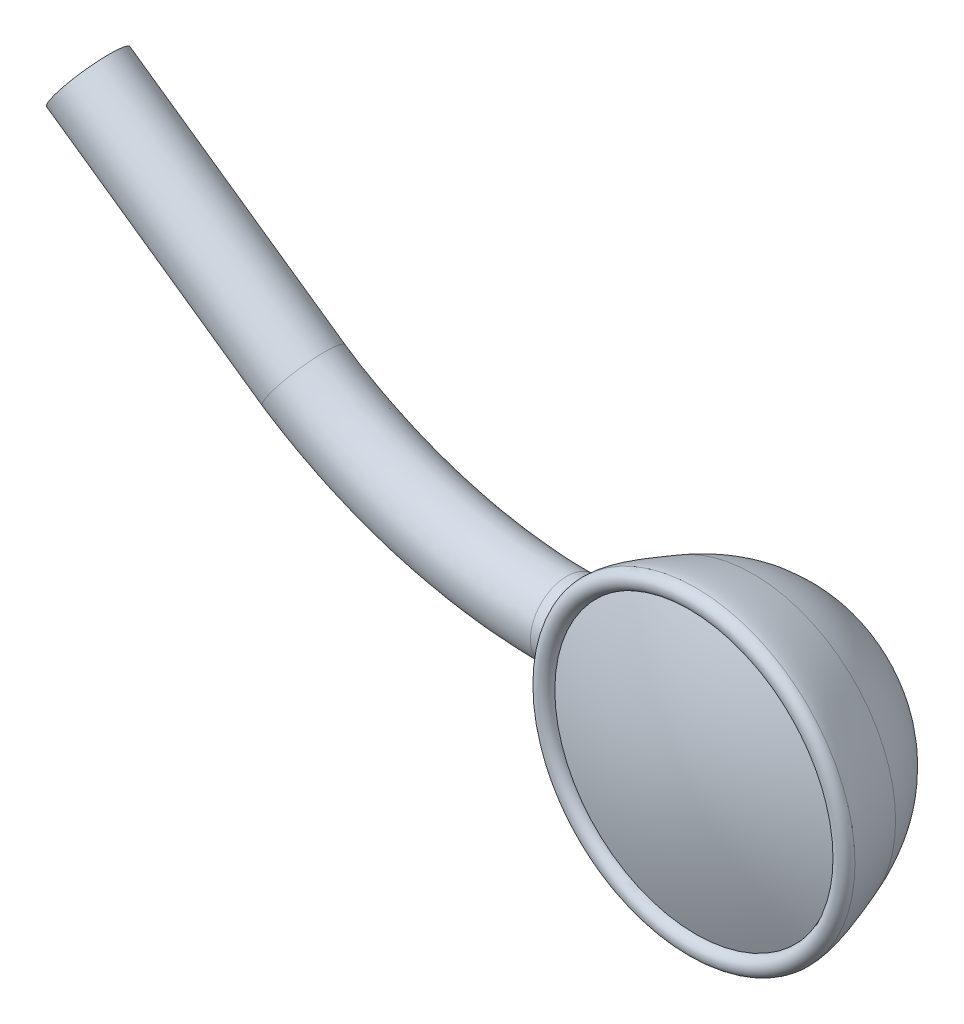
ISO-10303-21;
HEADER;
FILE_DESCRIPTION(('STEP AP214'),'2;1');
FILE_NAME('part.step','',(''),(''),'','','');
FILE_SCHEMA(('AUTOMOTIVE_DESIGN { 1 0 10303 214 1 1 1 1 }'));
ENDSEC;
DATA;
#1=APPLICATION_CONTEXT('core data for automotive mechanical design processes');
#2=APPLICATION_PROTOCOL_DEFINITION('international standard','automotive_design',2000,#1);
#3=PRODUCT_CONTEXT('',#1,'mechanical');
#4=PRODUCT('Part','Part','',(#3));
#5=PRODUCT_RELATED_PRODUCT_CATEGORY('part','',(#4));
#6=PRODUCT_DEFINITION_FORMATION('','',#4);
#7=PRODUCT_DEFINITION_CONTEXT('part definition',#1,'design');
#8=PRODUCT_DEFINITION('design','',#6,#7);
#9=PRODUCT_DEFINITION_SHAPE('','',#8);
#10=(LENGTH_UNIT() NAMED_UNIT(*) SI_UNIT(.MILLI.,.METRE.));
#11=(NAMED_UNIT(*) PLANE_ANGLE_UNIT() SI_UNIT($,.RADIAN.));
#12=(NAMED_UNIT(*) SI_UNIT($,.STERADIAN.) SOLID_ANGLE_UNIT());
#13=UNCERTAINTY_MEASURE_WITH_UNIT(LENGTH_MEASURE(1.E-05),#10,'distance_accuracy_value','');
#14=(GEOMETRIC_REPRESENTATION_CONTEXT(3) GLOBAL_UNCERTAINTY_ASSIGNED_CONTEXT((#13)) GLOBAL_UNIT_ASSIGNED_CONTEXT((#10,
#11,#12)) REPRESENTATION_CONTEXT('',''));
#15=CARTESIAN_POINT('',(0.,0.,0.));
#16=DIRECTION('',(0.,0.,1.));
#17=DIRECTION('',(1.,0.,0.));
#18=AXIS2_PLACEMENT_3D('',#15,#16,#17);
#19=CARTESIAN_POINT('',(-33.3759610218491,6.32528048127308,38.7475650776062));
#20=DIRECTION('',(0.,0.,-1.));
#21=DIRECTION('',(-1.,0.,0.));
#22=AXIS2_PLACEMENT_3D('',#19,#20,#21);
#23=TOROIDAL_SURFACE('',#22,2.67006462568478,0.161745723488841);
#24=CARTESIAN_POINT('',(-33.3759610218491,6.32528048127308,38.7475650776062));
#25=DIRECTION('',(0.,0.,-1.));
#26=DIRECTION('',(-1.,0.,0.));
#27=AXIS2_PLACEMENT_3D('',#24,#25,#26);
#28=CIRCLE('',#27,2.83181034917362);
#29=CARTESIAN_POINT('',(-36.2077713710227,6.32528048127308,38.7475650776062));
#30=VERTEX_POINT('',#29);
#31=EDGE_CURVE('E12',#30,#30,#28,.T.);
#32=ORIENTED_EDGE('',*,*,#31,.F.);
#33=EDGE_LOOP('',(#32));
#34=FACE_BOUND('',#33,.T.);
#35=CARTESIAN_POINT('',(-33.3759610218491,6.32528048127308,38.7475650776062));
#36=DIRECTION('',(0.,0.,-1.));
#37=DIRECTION('',(-1.,0.,0.));
#38=AXIS2_PLACEMENT_3D('',#35,#36,#37);
#39=CIRCLE('',#38,2.50831890219594);
#40=CARTESIAN_POINT('',(-35.884279924045,6.32528048127308,38.7475650776062));
#41=VERTEX_POINT('',#40);
#42=EDGE_CURVE('E60',#41,#41,#39,.T.);
#43=ORIENTED_EDGE('',*,*,#42,.T.);
#44=EDGE_LOOP('',(#43));
#45=FACE_BOUND('',#44,.T.);
#46=ADVANCED_FACE('F51',(#34,#45),#23,.T.);
#47=CARTESIAN_POINT('',(-35.9127425481212,6.32528048127308,37.7293758331895));
#48=CARTESIAN_POINT('',(-36.2077713710227,6.32528048127308,38.5109618998965));
#49=CARTESIAN_POINT('',(-36.2077713710227,6.32528048127308,38.7475650776062));
#50=B_SPLINE_CURVE_WITH_KNOTS('',2,(#47,#48,#49),.UNSPECIFIED.,.F.,.F.,(3,3),(0.,1.),.UNSPECIFIED.);
#51=CARTESIAN_POINT('',(-33.3759610218491,6.32528048127308,38.5428918715614));
#52=DIRECTION('',(0.,0.,-1.));
#53=AXIS1_PLACEMENT('',#51,#52);
#54=SURFACE_OF_REVOLUTION('',#50,#53);
#55=CARTESIAN_POINT('',(-35.8366631157367,5.70867224489234,37.7293758331895));
#56=CARTESIAN_POINT('',(-35.8453147656156,5.71452767314581,37.7478391693856));
#57=CARTESIAN_POINT('',(-35.8539920785709,5.72120791889198,37.7660284696626));
#58=CARTESIAN_POINT('',(-35.8712876700008,5.73616983047684,37.8017269053988));
#59=CARTESIAN_POINT('',(-35.8799060170333,5.74444910215327,37.8192370113018));
#60=CARTESIAN_POINT('',(-35.8970412696356,5.762622664758,37.8535839734428));
#61=CARTESIAN_POINT('',(-35.9055574758623,5.77252463210552,37.8704171314708));
#62=CARTESIAN_POINT('',(-35.9223543983339,5.79388971006259,37.9032308382117));
#63=CARTESIAN_POINT('',(-35.9306346520882,5.80535566168821,37.9192097599116));
#64=CARTESIAN_POINT('',(-35.9549532042186,5.84204030133587,37.9656690435886));
#65=CARTESIAN_POINT('',(-35.9704698752245,5.8695463807755,37.9946730778542));
#66=CARTESIAN_POINT('',(-35.9991382954304,5.93010767040174,38.0475458642674));
#67=CARTESIAN_POINT('',(-36.0122932617168,5.96315521147534,38.0714216109567));
#68=CARTESIAN_POINT('',(-36.0343666785619,6.03106128283361,38.1111550953871));
#69=CARTESIAN_POINT('',(-36.0435473206518,6.06553759645398,38.1275161897194));
#70=CARTESIAN_POINT('',(-36.058489990327,6.13749361235207,38.154037548141));
#71=CARTESIAN_POINT('',(-36.0642549687797,6.174970690331,38.1642031648585));
#72=CARTESIAN_POINT('',(-36.0713948901646,6.24645254162278,38.1767776085079));
#73=CARTESIAN_POINT('',(-36.0732489874549,6.28026239279216,38.1800334158611));
#74=CARTESIAN_POINT('',(-36.0739118411888,6.3479971320981,38.1811983512119));
#75=CARTESIAN_POINT('',(-36.0727219839279,6.38192196084309,38.1791099131167));
#76=CARTESIAN_POINT('',(-36.067549850494,6.44666859070041,38.1700080191207));
#77=CARTESIAN_POINT('',(-36.0637488489278,6.47755098267108,38.1633142386376));
#78=CARTESIAN_POINT('',(-36.0537645140728,6.53765780749648,38.1456573066964));
#79=CARTESIAN_POINT('',(-36.0475809878503,6.56688210586105,38.1346938094815));
#80=CARTESIAN_POINT('',(-36.032876022572,6.62408724168076,38.1084571177646));
#81=CARTESIAN_POINT('',(-36.0242754920397,6.65198014113223,38.0930375124248));
#82=CARTESIAN_POINT('',(-36.0052503914948,6.70482379786665,38.0586126119636));
#83=CARTESIAN_POINT('',(-35.9948225777268,6.72976918868674,38.039600935496));
#84=CARTESIAN_POINT('',(-35.9713876340448,6.77883309682954,37.9963480865731));
#85=CARTESIAN_POINT('',(-35.958223701485,6.80257385014605,37.9717643365286));
#86=CARTESIAN_POINT('',(-35.9307472441421,6.84570186071436,37.9195246275618));
#87=CARTESIAN_POINT('',(-35.9164325973089,6.8650808121964,37.8918629547694));
#88=CARTESIAN_POINT('',(-35.8911289179942,6.89464902248757,37.8418412877474));
#89=CARTESIAN_POINT('',(-35.8802726500873,6.9059103622867,37.8200382155502));
#90=CARTESIAN_POINT('',(-35.8584852652785,6.92583916467082,37.7754254213999));
#91=CARTESIAN_POINT('',(-35.8475545596775,6.93451583809476,37.7526196146741));
#92=CARTESIAN_POINT('',(-35.8366631157367,6.94188871765382,37.7293758331895));
#93=B_SPLINE_CURVE_WITH_KNOTS('',3,(#55,#56,#57,#58,#59,#60,#61,#62,#63,#64,#65,#66,#67,#68,#69,
#70,#71,#72,#73,#74,#75,#76,#77,#78,#79,#80,#81,#82,#83,#84,#85,#86,#87,#88,#89,#90,#91,#92),
.UNSPECIFIED.,.F.,.F.,(4,2,2,2,2,2,2,2,2,2,2,2,2,2,2,2,2,2,4),(0.,0.0636232112335555,
0.127151890119804,0.190990269760106,0.25494619728965,0.382853825182514,0.510585874470745,
0.627642135828131,0.744597121676691,0.846109210507948,0.947575076345156,1.0426268804407,
1.13768638332432,1.23631646841177,1.33512344686202,1.44456174789036,1.55420671139311,
1.63457071346741,1.71464480296047),.UNSPECIFIED.);
#94=CARTESIAN_POINT('',(-35.8366631157367,5.70867224489234,37.7293758331895));
#95=VERTEX_POINT('',#94);
#96=CARTESIAN_POINT('',(-35.8366631157367,6.94188871765382,37.7293758331895));
#97=VERTEX_POINT('',#96);
#98=EDGE_CURVE('E66',#95,#97,#93,.T.);
#99=ORIENTED_EDGE('',*,*,#98,.F.);
#100=CARTESIAN_POINT('',(-33.3759610218491,6.32528048127308,37.7293758331895));
#101=DIRECTION('',(0.,0.,-1.));
#102=DIRECTION('',(-1.,0.,0.));
#103=AXIS2_PLACEMENT_3D('',#100,#101,#102);
#104=CIRCLE('',#103,2.53678152627212);
#105=EDGE_CURVE('E69',#97,#95,#104,.T.);
#106=ORIENTED_EDGE('',*,*,#105,.F.);
#107=EDGE_LOOP('',(#99,#106));
#108=FACE_BOUND('',#107,.T.);
#109=ORIENTED_EDGE('',*,*,#31,.T.);
#110=EDGE_LOOP('',(#109));
#111=FACE_BOUND('',#110,.T.);
#112=ADVANCED_FACE('F137',(#108,#111),#54,.F.);
#113=CARTESIAN_POINT('',(-33.3759610218491,6.32528048127308,35.9982186655167));
#114=CARTESIAN_POINT('',(-35.2592748326744,6.32528048127308,35.9982186655167));
#115=CARTESIAN_POINT('',(-35.9127425481212,6.32528048127308,37.7293758331895));
#116=B_SPLINE_CURVE_WITH_KNOTS('',2,(#113,#114,#115),.UNSPECIFIED.,.F.,.F.,(3,3),(0.,1.),.UNSPECIFIED.);
#117=CARTESIAN_POINT('',(-33.3759610218491,6.32528048127308,38.5428918715614));
#118=DIRECTION('',(0.,0.,-1.));
#119=AXIS1_PLACEMENT('',#117,#118);
#120=SURFACE_OF_REVOLUTION('',#116,#119);
#121=CARTESIAN_POINT('',(-35.8366631157367,6.94188871765382,37.7293758331895));
#122=CARTESIAN_POINT('',(-35.8187976448711,6.95398969437908,37.6912685161995));
#123=CARTESIAN_POINT('',(-35.8006042696638,6.96247814504994,37.6521891302451));
#124=CARTESIAN_POINT('',(-35.7640102154432,6.97216974226241,37.573215834083));
#125=CARTESIAN_POINT('',(-35.7456094776004,6.97337076640056,37.5333216899776));
#126=CARTESIAN_POINT('',(-35.7089951677291,6.96841133757217,37.4537307872917));
#127=CARTESIAN_POINT('',(-35.6907824936837,6.96222469799498,37.4140352346901));
#128=CARTESIAN_POINT('',(-35.6550515672563,6.94251648062271,37.3361841881156));
#129=CARTESIAN_POINT('',(-35.6375331294374,6.92899687589493,37.2980282828384));
#130=CARTESIAN_POINT('',(-35.6038693444127,6.89504388058971,37.2249579996403));
#131=CARTESIAN_POINT('',(-35.5877092302884,6.87470168570272,37.1900082307804));
#132=CARTESIAN_POINT('',(-35.5570327507096,6.8274400956231,37.1240668069465));
#133=CARTESIAN_POINT('',(-35.5425151374896,6.80052574289379,37.0930721450595));
#134=CARTESIAN_POINT('',(-35.5165618089117,6.74260600255518,37.0380909245191));
#135=CARTESIAN_POINT('',(-35.5049895753441,6.71196504811429,37.0137859250618));
#136=CARTESIAN_POINT('',(-35.4843827204404,6.64619481637912,36.9708236777989));
#137=CARTESIAN_POINT('',(-35.4753460519089,6.61106919350858,36.9521618727705));
#138=CARTESIAN_POINT('',(-35.4611126198351,6.540990930282,36.9229371743526));
#139=CARTESIAN_POINT('',(-35.4556288291746,6.50635068095155,36.9117651717619));
#140=CARTESIAN_POINT('',(-35.4475616494678,6.43536976003189,36.8953747965783));
#141=CARTESIAN_POINT('',(-35.4449762422825,6.39903028999596,36.8901522813274));
#142=CARTESIAN_POINT('',(-35.4429819281987,6.32909436212129,36.8861221759403));
#143=CARTESIAN_POINT('',(-35.4433165404108,6.29553391480288,36.8867966338481));
#144=CARTESIAN_POINT('',(-35.4465337361661,6.22904564377892,36.8933029655456));
#145=CARTESIAN_POINT('',(-35.4494159951513,6.19611774003627,36.8991341823888));
#146=CARTESIAN_POINT('',(-35.4574690229153,6.13249177168752,36.9155163629443));
#147=CARTESIAN_POINT('',(-35.462591786415,6.10176187744463,36.9259683694387));
#148=CARTESIAN_POINT('',(-35.4748573131789,6.042503818634,36.9511650450431));
#149=CARTESIAN_POINT('',(-35.4820031214208,6.01397905613864,36.9659161859712));
#150=CARTESIAN_POINT('',(-35.4984438882246,5.95827953904083,37.0001076393957));
#151=CARTESIAN_POINT('',(-35.5078349929002,5.93126387554369,37.0197602419739));
#152=CARTESIAN_POINT('',(-35.5281664596745,5.88088216429256,37.0626281364173));
#153=CARTESIAN_POINT('',(-35.5391077979726,5.85751843585092,37.0858456739391));
#154=CARTESIAN_POINT('',(-35.5632720118109,5.8128577948878,37.1374481502949));
#155=CARTESIAN_POINT('',(-35.57661206565,5.79194608742775,37.1661115933272));
#156=CARTESIAN_POINT('',(-35.6043641106021,5.75525924235879,37.2260314506855));
#157=CARTESIAN_POINT('',(-35.6187753297745,5.73948044894578,37.2572859995571));
#158=CARTESIAN_POINT('',(-35.6496455525438,5.71209656189135,37.3243969806427));
#159=CARTESIAN_POINT('',(-35.6661738316155,5.7009710110398,37.3604175680021));
#160=CARTESIAN_POINT('',(-35.6997655293028,5.68512817568966,37.4336087985326));
#161=CARTESIAN_POINT('',(-35.716829175657,5.68041365723809,37.4707799310382));
#162=CARTESIAN_POINT('',(-35.7511735444519,5.67743704264421,37.5453886990146));
#163=CARTESIAN_POINT('',(-35.7684546919304,5.67919057189535,37.5828267615049));
#164=CARTESIAN_POINT('',(-35.8028085623448,5.68912654515443,37.6569210512252));
#165=CARTESIAN_POINT('',(-35.8198813490243,5.69730697024427,37.6935775202681));
#166=CARTESIAN_POINT('',(-35.8366631157367,5.70867224489234,37.7293758331895));
#167=B_SPLINE_CURVE_WITH_KNOTS('',3,(#121,#122,#123,#124,#125,#126,#127,#128,#129,#130,#131,
#132,#133,#134,#135,#136,#137,#138,#139,#140,#141,#142,#143,#144,#145,#146,#147,#148,#149,#150,
#151,#152,#153,#154,#155,#156,#157,#158,#159,#160,#161,#162,#163,#164,#165,#166),.UNSPECIFIED.,
.F.,.F.,(4,2,2,2,2,2,2,2,2,2,2,2,2,2,2,2,2,2,2,2,2,2,4),(0.,0.131196476934538,0.262431161937915,
0.394132410836811,0.525798240692179,0.655769967901991,0.785642286402137,0.907334820292381,
1.02892881598144,1.13875250891483,1.24849968422563,1.34871115793164,1.44890986701332,
1.54705951724704,1.6453576896927,1.74903050748719,1.85276890178943,1.96600728045525,
2.07916483011441,2.20211799567523,2.32512419270205,2.44842774029227,2.5716925693032),.UNSPECIFIED.);
#168=EDGE_CURVE('E96',#97,#95,#167,.T.);
#169=ORIENTED_EDGE('',*,*,#168,.F.);
#170=ORIENTED_EDGE('',*,*,#105,.T.);
#171=EDGE_LOOP('',(#169,#170));
#172=FACE_BOUND('',#171,.T.);
#173=CARTESIAN_POINT('',(-33.3759610218491,6.32528048127308,35.9982186655167));
#174=VERTEX_POINT('',#173);
#175=VERTEX_LOOP('',#174);
#176=FACE_BOUND('',#175,.T.);
#177=ADVANCED_FACE('F142',(#172,#176),#120,.F.);
#178=CARTESIAN_POINT('',(-33.3759610218491,6.32528048127308,39.2406431042212));
#179=CARTESIAN_POINT('',(-34.4827701193776,6.32528048127308,39.2406431042212));
#180=CARTESIAN_POINT('',(-35.884279924045,6.32528048127308,38.7475650776062));
#181=B_SPLINE_CURVE_WITH_KNOTS('',2,(#178,#179,#180),.UNSPECIFIED.,.F.,.F.,(3,3),(0.,1.),.UNSPECIFIED.);
#182=CARTESIAN_POINT('',(-33.3759610218491,6.32528048127308,38.5428918715614));
#183=DIRECTION('',(0.,0.,-1.));
#184=AXIS1_PLACEMENT('',#182,#183);
#185=SURFACE_OF_REVOLUTION('',#181,#184);
#186=ORIENTED_EDGE('',*,*,#42,.F.);
#187=EDGE_LOOP('',(#186));
#188=FACE_BOUND('',#187,.T.);
#189=CARTESIAN_POINT('',(-33.3759610218491,6.32528048127308,39.2406431042212));
#190=VERTEX_POINT('',#189);
#191=VERTEX_LOOP('',#190);
#192=FACE_BOUND('',#191,.T.);
#193=ADVANCED_FACE('F201',(#188,#192),#185,.T.);
#194=CARTESIAN_POINT('',(-41.5458276981099,7.71518263846036,37.5338437701228));
#195=DIRECTION('',(-0.819145587525573,0.573585657454389,0.));
#196=DIRECTION('',(-0.573585657454389,-0.819145587525573,0.));
#197=AXIS2_PLACEMENT_3D('',#194,#195,#196);
#198=CYLINDRICAL_SURFACE('',#197,0.646868228358528);
#199=CARTESIAN_POINT('',(-41.5659610218439,7.72928048126944,36.8869755417643));
#200=CARTESIAN_POINT('',(-41.5647281483609,7.73109463158328,36.8869754854619));
#201=CARTESIAN_POINT('',(-41.5634951329623,7.73290900140354,36.8869866456106));
#202=CARTESIAN_POINT('',(-41.5418656374338,7.76473677412808,36.8873789691759));
#203=CARTESIAN_POINT('',(-41.5214507065554,7.79478022553053,36.8908149240512));
#204=CARTESIAN_POINT('',(-41.4812004119349,7.85401971277557,36.9037415882397));
#205=CARTESIAN_POINT('',(-41.4613667975174,7.88321318937228,36.9132489319743));
#206=CARTESIAN_POINT('',(-41.4229046216775,7.93983134716963,36.9380450181942));
#207=CARTESIAN_POINT('',(-41.4042743816033,7.96725849215577,36.9533254941513));
#208=CARTESIAN_POINT('',(-41.3687210726389,8.0196036946887,36.989237710197));
#209=CARTESIAN_POINT('',(-41.3517981966115,8.04452146877801,37.0098700538912));
#210=CARTESIAN_POINT('',(-41.3201428568861,8.09113507435313,37.0558957326574));
#211=CARTESIAN_POINT('',(-41.3054100345007,8.1128314334422,37.0812882865575));
#212=CARTESIAN_POINT('',(-41.2785478690496,8.15239246419197,37.1361196290507));
#213=CARTESIAN_POINT('',(-41.2664188657342,8.17025663582281,37.1655589448505));
#214=CARTESIAN_POINT('',(-41.245111982669,8.20163985317129,37.2276413577989));
#215=CARTESIAN_POINT('',(-41.2359337171876,8.21515946682577,37.2602840354634));
#216=CARTESIAN_POINT('',(-41.2207868030357,8.23747158926488,37.3278476222613));
#217=CARTESIAN_POINT('',(-41.2148179571284,8.24626438853847,37.3627683912454));
#218=CARTESIAN_POINT('',(-41.2062584499204,8.25887369733079,37.4338962981846));
#219=CARTESIAN_POINT('',(-41.2036675761753,8.26269051979406,37.4701033550964));
#220=CARTESIAN_POINT('',(-41.2019367381869,8.26524034387295,37.5427780503737));
#221=CARTESIAN_POINT('',(-41.2027967758199,8.2639733427245,37.5792456888808));
#222=CARTESIAN_POINT('',(-41.2079432549403,8.25639175325856,37.6514042943082));
#223=CARTESIAN_POINT('',(-41.2122295151951,8.25007743192282,37.6870953022065));
#224=CARTESIAN_POINT('',(-41.2241068456052,8.23258096825233,37.7566900156184));
#225=CARTESIAN_POINT('',(-41.2316979604693,8.22139876006375,37.7905936969458));
#226=CARTESIAN_POINT('',(-41.2499704800104,8.19448358233065,37.8556530558488));
#227=CARTESIAN_POINT('',(-41.2606520825856,8.1787503213613,37.886808557279));
#228=CARTESIAN_POINT('',(-41.2848015738925,8.14318214891033,37.9454821218327));
#229=CARTESIAN_POINT('',(-41.2982692028154,8.1233476198894,37.9730005237393));
#230=CARTESIAN_POINT('',(-41.327613082083,8.08013456377535,38.0236288172666));
#231=CARTESIAN_POINT('',(-41.3434899194678,8.05675517292396,38.0467376313178));
#232=CARTESIAN_POINT('',(-41.3772000521848,8.00711962245357,38.0878820951208));
#233=CARTESIAN_POINT('',(-41.3950333018665,7.98086352995895,38.105917863211));
#234=CARTESIAN_POINT('',(-41.4321674802068,7.92619541527105,38.1364215056775));
#235=CARTESIAN_POINT('',(-41.4514699526992,7.89778112534949,38.1488834259367));
#236=CARTESIAN_POINT('',(-41.4909476367279,7.83967332920168,38.167836923611));
#237=CARTESIAN_POINT('',(-41.511120919375,7.80998265078541,38.1743410521048));
#238=CARTESIAN_POINT('',(-41.5416888291497,7.76499767846498,38.1795298381763));
#239=CARTESIAN_POINT('',(-41.5519740339199,7.74986228251233,38.1804923897584));
#240=CARTESIAN_POINT('',(-41.5634950199107,7.73290916777991,38.1807008363819));
#241=CARTESIAN_POINT('',(-41.5647280303148,7.73109480520629,38.1807119927025));
#242=CARTESIAN_POINT('',(-41.5659610216882,7.72928048115973,38.1807119984813));
#243=B_SPLINE_CURVE_WITH_KNOTS('',3,(#199,#200,#201,#202,#203,#204,#205,#206,#207,#208,#209,
#210,#211,#212,#213,#214,#215,#216,#217,#218,#219,#220,#221,#222,#223,#224,#225,#226,#227,#228,
#229,#230,#231,#232,#233,#234,#235,#236,#237,#238,#239,#240,#241,#242),.UNSPECIFIED.,.F.,.F.,(4,
2,2,2,2,2,2,2,2,2,2,2,2,2,2,2,2,2,2,2,2,4),(0.,0.00658101548424844,0.115437513564387,
0.224593544319637,0.333593863689706,0.442606481911784,0.551601226309611,0.660610183874311,
0.7696048855785,0.878592888187748,0.987574036093227,1.09655524325138,1.20553068614911,
1.31450760333605,1.42349150036091,1.53246523875325,1.64146557301609,1.75046336442909,
1.85957731341215,1.96846086348973,2.0233734654485,2.02995448093012),.UNSPECIFIED.);
#244=CARTESIAN_POINT('',(-41.5659610216882,7.72928048115973,38.1807119984813));
#245=VERTEX_POINT('',#244);
#246=CARTESIAN_POINT('',(-41.5659610218439,7.72928048126944,36.8869755417643));
#247=VERTEX_POINT('',#246);
#248=EDGE_CURVE('E88',#245,#247,#243,.F.);
#249=ORIENTED_EDGE('',*,*,#248,.T.);
#250=CARTESIAN_POINT('',(-41.5659610218439,7.72928048126944,36.8869755417643));
#251=CARTESIAN_POINT('',(-41.5671938952713,7.7274663309195,36.8869754854618));
#252=CARTESIAN_POINT('',(-41.5684269155891,7.72565196444201,36.8869866456106));
#253=CARTESIAN_POINT('',(-41.5900564879902,7.69382445104794,36.8873789674739));
#254=CARTESIAN_POINT('',(-41.6104728406544,7.66378217306282,36.8908148923825));
#255=CARTESIAN_POINT('',(-41.6507285014472,7.60454673623037,36.9037414631485));
#256=CARTESIAN_POINT('',(-41.670566067209,7.57535614126758,36.9132487430969));
#257=CARTESIAN_POINT('',(-41.7090382114242,7.51874513118435,36.9380446879608));
#258=CARTESIAN_POINT('',(-41.727674465361,7.49132225061213,36.9533250874507));
#259=CARTESIAN_POINT('',(-41.7632411932853,7.43898651661452,36.9892371423085));
#260=CARTESIAN_POINT('',(-41.7801714745796,7.41407394673383,37.009869401241));
#261=CARTESIAN_POINT('',(-41.8118421498578,7.3674711862283,37.0558948376491));
#262=CARTESIAN_POINT('',(-41.8265829080644,7.34578045965643,37.0812872216943));
#263=CARTESIAN_POINT('',(-41.8534606369081,7.3062304296201,37.1361181822838));
#264=CARTESIAN_POINT('',(-41.8655972677255,7.2883716261938,37.1655572860744));
#265=CARTESIAN_POINT('',(-41.8869182653625,7.25699821670113,37.2276393220011));
#266=CARTESIAN_POINT('',(-41.8961030096511,7.24348305519681,37.2602818438066));
#267=CARTESIAN_POINT('',(-41.9112609596368,7.22117844550604,37.3278451009158));
#268=CARTESIAN_POINT('',(-41.917234362503,7.2123887071891,37.3627656962032));
#269=CARTESIAN_POINT('',(-41.9258005731046,7.19978370625774,37.4338935043636));
#270=CARTESIAN_POINT('',(-41.928393569747,7.19596816567043,37.4701006452245));
#271=CARTESIAN_POINT('',(-41.9301259280341,7.19341903649985,37.5427755312735));
#272=CARTESIAN_POINT('',(-41.9292652876892,7.19468545084432,37.5792432766116));
#273=CARTESIAN_POINT('',(-41.9241149424387,7.20226407676301,37.6514022880552));
#274=CARTESIAN_POINT('',(-41.9198254034782,7.20857604415235,37.6870935916516));
#275=CARTESIAN_POINT('',(-41.907939218523,7.2260663187696,37.7566889049717));
#276=CARTESIAN_POINT('',(-41.9003425278135,7.2372446917941,37.7905928905228));
#277=CARTESIAN_POINT('',(-41.8820572221055,7.26415114175702,37.8556527620869));
#278=CARTESIAN_POINT('',(-41.8713684166754,7.27987949891144,37.8868084786903));
#279=CARTESIAN_POINT('',(-41.8472036963466,7.31543738986324,37.9454824416181));
#280=CARTESIAN_POINT('',(-41.8337280414881,7.33526654101667,37.9730010269298));
#281=CARTESIAN_POINT('',(-41.8043683558477,7.37846872313157,38.0236293273614));
#282=CARTESIAN_POINT('',(-41.788483766207,7.40184257644326,38.0467380165943));
#283=CARTESIAN_POINT('',(-41.7547591263281,7.4514677091578,38.0878822672538));
#284=CARTESIAN_POINT('',(-41.7369191217676,7.47771892134685,38.1059179471486));
#285=CARTESIAN_POINT('',(-41.6997731790159,7.53237844497694,38.1364214514756));
#286=CARTESIAN_POINT('',(-41.6804656989497,7.56078902526405,38.1488833221897));
#287=CARTESIAN_POINT('',(-41.6409803321955,7.61889098017917,38.1678367746919));
#288=CARTESIAN_POINT('',(-41.6208043694274,7.64857952377975,38.1743409070306));
#289=CARTESIAN_POINT('',(-41.5902341399916,7.69356304098402,38.1795297999757));
#290=CARTESIAN_POINT('',(-41.5799483098046,7.70869844798611,38.1804923860615));
#291=CARTESIAN_POINT('',(-41.5684270286112,7.72565179804188,38.1807008363826));
#292=CARTESIAN_POINT('',(-41.5671940131873,7.72746615720469,38.1807119927034));
#293=CARTESIAN_POINT('',(-41.5659610216882,7.72928048115973,38.1807119984813));
#294=B_SPLINE_CURVE_WITH_KNOTS('',3,(#250,#251,#252,#253,#254,#255,#256,#257,#258,#259,#260,
#261,#262,#263,#264,#265,#266,#267,#268,#269,#270,#271,#272,#273,#274,#275,#276,#277,#278,#279,
#280,#281,#282,#283,#284,#285,#286,#287,#288,#289,#290,#291,#292,#293),.UNSPECIFIED.,.F.,.F.,(4,
2,2,2,2,2,2,2,2,2,2,2,2,2,2,2,2,2,2,2,2,4),(0.,0.00658101548424417,0.115436999697637,
0.224592510870852,0.333592331750144,0.442604450612663,0.55159841517516,0.660606594020465,
0.769600828025483,0.878588369262203,0.987569819691704,1.09655133290578,1.20552757216333,
1.31450528488814,1.42348971056007,1.53246397151005,1.64146355263739,1.75046058812612,
1.85957377342029,1.96845656906304,2.02337025259647,2.02995126807806),.UNSPECIFIED.);
#295=EDGE_CURVE('E84',#245,#247,#294,.F.);
#296=ORIENTED_EDGE('',*,*,#295,.F.);
#297=EDGE_LOOP('',(#249,#296));
#298=FACE_BOUND('',#297,.T.);
#299=CARTESIAN_POINT('',(-45.3995623714688,10.4136613581596,37.5338437701228));
#300=DIRECTION('',(-0.819145587525573,0.573585657454389,0.));
#301=DIRECTION('',(-0.573585657454389,-0.819145587525573,0.));
#302=AXIS2_PLACEMENT_3D('',#299,#300,#301);
#303=CIRCLE('',#302,0.646868228358528);
#304=CARTESIAN_POINT('',(-45.7705967095182,9.88378210318925,37.5338437701228));
#305=VERTEX_POINT('',#304);
#306=EDGE_CURVE('E195',#305,#305,#303,.T.);
#307=ORIENTED_EDGE('',*,*,#306,.F.);
#308=EDGE_LOOP('',(#307));
#309=FACE_BOUND('',#308,.T.);
#310=ADVANCED_FACE('F86',(#298,#309),#198,.T.);
#311=CARTESIAN_POINT('',(-33.3759610218491,6.32528048127308,37.5338437701228));
#312=DIRECTION('',(-1.,0.,0.));
#313=DIRECTION('',(0.,0.,1.));
#314=AXIS2_PLACEMENT_3D('',#311,#312,#313);
#315=CYLINDRICAL_SURFACE('',#314,0.646868228358528);
#316=ORIENTED_EDGE('',*,*,#168,.T.);
#317=ORIENTED_EDGE('',*,*,#98,.T.);
#318=EDGE_LOOP('',(#316,#317));
#319=FACE_BOUND('',#318,.T.);
#320=CARTESIAN_POINT('',(-36.8859610218491,6.32528048127308,37.5338437701228));
#321=DIRECTION('',(1.,0.,0.));
#322=DIRECTION('',(0.,0.,-1.));
#323=AXIS2_PLACEMENT_3D('',#320,#321,#322);
#324=CIRCLE('',#323,0.646868228358528);
#325=CARTESIAN_POINT('',(-36.8859610218491,6.32528048127308,36.8869755417643));
#326=VERTEX_POINT('',#325);
#327=EDGE_CURVE('E91',#326,#326,#324,.F.);
#328=ORIENTED_EDGE('',*,*,#327,.F.);
#329=EDGE_LOOP('',(#328));
#330=FACE_BOUND('',#329,.T.);
#331=ADVANCED_FACE('F124',(#319,#330),#315,.T.);
#332=CARTESIAN_POINT('',(-36.8859610218491,6.32528048127308,36.8869755417643));
#333=CARTESIAN_POINT('',(-37.7119495773994,6.32528048127308,36.8869755417643));
#334=CARTESIAN_POINT('',(-38.5378391972976,6.44649534003531,36.8869755417643));
#335=CARTESIAN_POINT('',(-39.7245695187525,6.80251443646662,36.8869755417643));
#336=CARTESIAN_POINT('',(-40.1114650181482,6.95005427973614,36.8869755417643));
#337=CARTESIAN_POINT('',(-40.6726925738525,7.21234060507263,36.8869755417643));
#338=CARTESIAN_POINT('',(-40.8565826105013,7.30658836622532,36.8869755417643));
#339=CARTESIAN_POINT('',(-41.1269062232192,7.4578131856424,36.8869755417643));
#340=CARTESIAN_POINT('',(-41.2160958720208,7.50986312050678,36.8869755417643));
#341=CARTESIAN_POINT('',(-41.3484152724599,7.59034941732865,36.8869755417643));
#342=CARTESIAN_POINT('',(-41.3922775908833,7.61758005640369,36.8869755417643));
#343=CARTESIAN_POINT('',(-41.4576941693031,7.65902223134619,36.8869755417643));
#344=CARTESIAN_POINT('',(-41.4794368810188,7.67293565774328,36.8869755417643));
#345=CARTESIAN_POINT('',(-41.5119554118383,7.69395401429639,36.8869755417643));
#346=CARTESIAN_POINT('',(-41.5227789994576,7.70098483590224,36.8869755417643));
#347=CARTESIAN_POINT('',(-41.5443941118701,7.71509574460408,36.8869755417643));
#348=CARTESIAN_POINT('',(-41.5551856269097,7.72217584654398,36.8869755417643));
#349=CARTESIAN_POINT('',(-41.5728009007633,7.73379027804157,36.8869755417643));
#350=CARTESIAN_POINT('',(-41.5796407672953,7.73830009365507,36.8869755417643));
#351=CARTESIAN_POINT('',(-41.5864806400184,7.74280989984625,36.8869755417643));
#352=CARTESIAN_POINT('',(-36.8859610218491,5.03154402455603,36.8869755417643));
#353=CARTESIAN_POINT('',(-37.8376390042573,5.03154402455603,36.8869755417643));
#354=CARTESIAN_POINT('',(-38.78920299613,5.17120396469523,36.8869755417643));
#355=CARTESIAN_POINT('',(-40.1565162723129,5.58139794754795,36.8869755417643));
#356=CARTESIAN_POINT('',(-40.6022850735782,5.75138870519685,36.8869755417643));
#357=CARTESIAN_POINT('',(-41.2489137759984,6.0535867432107,36.8869755417643));
#358=CARTESIAN_POINT('',(-41.460786080869,6.16217604336208,36.8869755417643));
#359=CARTESIAN_POINT('',(-41.7722444281065,6.33641251439555,36.8869755417643));
#360=CARTESIAN_POINT('',(-41.8750059306148,6.39638280897562,36.8869755417643));
#361=CARTESIAN_POINT('',(-42.0274601737123,6.48911658362212,36.8869755417643));
#362=CARTESIAN_POINT('',(-42.0779969546646,6.52049086778201,36.8869755417643));
#363=CARTESIAN_POINT('',(-42.1533678746951,6.56823923568711,36.8869755417643));
#364=CARTESIAN_POINT('',(-42.1784191419053,6.58426984709579,36.8869755417643));
#365=CARTESIAN_POINT('',(-42.2158859682836,6.60848653511588,36.8869755417643));
#366=CARTESIAN_POINT('',(-42.2283565648294,6.61658722619155,36.8869755417643));
#367=CARTESIAN_POINT('',(-42.2532608161442,6.63284537048796,36.8869755417643));
#368=CARTESIAN_POINT('',(-42.2665142966924,6.64154339269124,36.8869755417643));
#369=CARTESIAN_POINT('',(-42.2854698165239,6.65404149756322,36.8869755417643));
#370=CARTESIAN_POINT('',(-42.2917892755799,6.65820818942343,36.8869755417643));
#371=CARTESIAN_POINT('',(-42.298629148303,6.66271799561458,36.8869755417643));
#372=CARTESIAN_POINT('',(-36.8859610218491,5.03154402455603,38.1807119984813));
#373=CARTESIAN_POINT('',(-37.8376390042573,5.03154402455603,38.1807119984813));
#374=CARTESIAN_POINT('',(-38.78920299613,5.17120396469523,38.1807119984813));
#375=CARTESIAN_POINT('',(-40.1565162723129,5.58139794754795,38.1807119984813));
#376=CARTESIAN_POINT('',(-40.6022850735782,5.75138870519685,38.1807119984813));
#377=CARTESIAN_POINT('',(-41.2489137759984,6.0535867432107,38.1807119984813));
#378=CARTESIAN_POINT('',(-41.460786080869,6.16217604336208,38.1807119984813));
#379=CARTESIAN_POINT('',(-41.7722444281065,6.33641251439555,38.1807119984813));
#380=CARTESIAN_POINT('',(-41.8750059306148,6.39638280897562,38.1807119984813));
#381=CARTESIAN_POINT('',(-42.0274601737123,6.48911658362212,38.1807119984813));
#382=CARTESIAN_POINT('',(-42.0779969546646,6.52049086778201,38.1807119984813));
#383=CARTESIAN_POINT('',(-42.1533678746951,6.56823923568711,38.1807119984813));
#384=CARTESIAN_POINT('',(-42.1784191419053,6.58426984709579,38.1807119984813));
#385=CARTESIAN_POINT('',(-42.2158859682836,6.60848653511588,38.1807119984813));
#386=CARTESIAN_POINT('',(-42.2283565648294,6.61658722619155,38.1807119984813));
#387=CARTESIAN_POINT('',(-42.2532608161442,6.63284537048796,38.1807119984813));
#388=CARTESIAN_POINT('',(-42.2665142966924,6.64154339269124,38.1807119984813));
#389=CARTESIAN_POINT('',(-42.2854698165239,6.65404149756322,38.1807119984813));
#390=CARTESIAN_POINT('',(-42.2917892755799,6.65820818942343,38.1807119984813));
#391=CARTESIAN_POINT('',(-42.298629148303,6.66271799561458,38.1807119984813));
#392=CARTESIAN_POINT('',(-36.8859610218491,6.32528048127308,38.1807119984813));
#393=CARTESIAN_POINT('',(-37.7119495773994,6.32528048127308,38.1807119984813));
#394=CARTESIAN_POINT('',(-38.5378391972976,6.44649534003531,38.1807119984813));
#395=CARTESIAN_POINT('',(-39.7245695187525,6.80251443646662,38.1807119984813));
#396=CARTESIAN_POINT('',(-40.1114650181482,6.95005427973614,38.1807119984813));
#397=CARTESIAN_POINT('',(-40.6726925738525,7.21234060507263,38.1807119984813));
#398=CARTESIAN_POINT('',(-40.8565826105013,7.30658836622532,38.1807119984813));
#399=CARTESIAN_POINT('',(-41.1269062232192,7.4578131856424,38.1807119984813));
#400=CARTESIAN_POINT('',(-41.2160958720208,7.50986312050678,38.1807119984813));
#401=CARTESIAN_POINT('',(-41.3484152724599,7.59034941732865,38.1807119984813));
#402=CARTESIAN_POINT('',(-41.3922775908833,7.61758005640369,38.1807119984813));
#403=CARTESIAN_POINT('',(-41.4576941693031,7.65902223134619,38.1807119984813));
#404=CARTESIAN_POINT('',(-41.4794368810188,7.67293565774328,38.1807119984813));
#405=CARTESIAN_POINT('',(-41.5119554118383,7.69395401429639,38.1807119984813));
#406=CARTESIAN_POINT('',(-41.5227789994576,7.70098483590224,38.1807119984813));
#407=CARTESIAN_POINT('',(-41.5443941118701,7.71509574460408,38.1807119984813));
#408=CARTESIAN_POINT('',(-41.5551856269097,7.72217584654398,38.1807119984813));
#409=CARTESIAN_POINT('',(-41.5728009007633,7.73379027804157,38.1807119984813));
#410=CARTESIAN_POINT('',(-41.5796407672953,7.73830009365507,38.1807119984813));
#411=CARTESIAN_POINT('',(-41.5864806400184,7.74280989984625,38.1807119984813));
#412=CARTESIAN_POINT('',(-36.8859610218491,7.61901693799014,38.1807119984813));
#413=CARTESIAN_POINT('',(-37.5862601505414,7.61901693799014,38.1807119984813));
#414=CARTESIAN_POINT('',(-38.2864753984652,7.72178671537539,38.1807119984813));
#415=CARTESIAN_POINT('',(-39.292622765192,8.02363092538529,38.1807119984813));
#416=CARTESIAN_POINT('',(-39.6206449627182,8.14871985427543,38.1807119984813));
#417=CARTESIAN_POINT('',(-40.0964713717066,8.37109446693455,38.1807119984813));
#418=CARTESIAN_POINT('',(-40.2523791401335,8.45100068908856,38.1807119984813));
#419=CARTESIAN_POINT('',(-40.4815680183319,8.57921385688925,38.1807119984813));
#420=CARTESIAN_POINT('',(-40.5571858134268,8.62334343203795,38.1807119984813));
#421=CARTESIAN_POINT('',(-40.6693703712075,8.69158225103519,38.1807119984813));
#422=CARTESIAN_POINT('',(-40.706558227102,8.71466924502536,38.1807119984813));
#423=CARTESIAN_POINT('',(-40.7620204639112,8.74980522700526,38.1807119984813));
#424=CARTESIAN_POINT('',(-40.7804546201322,8.76160146839077,38.1807119984813));
#425=CARTESIAN_POINT('',(-40.808024855393,8.77942149347689,38.1807119984813));
#426=CARTESIAN_POINT('',(-40.8172014340857,8.78538244561292,38.1807119984813));
#427=CARTESIAN_POINT('',(-40.835527407596,8.79734611872021,38.1807119984813));
#428=CARTESIAN_POINT('',(-40.843856957127,8.8028083003967,38.1807119984813));
#429=CARTESIAN_POINT('',(-40.8601319850028,8.81353905851991,38.1807119984813));
#430=CARTESIAN_POINT('',(-40.8674922590106,8.81839199788671,38.1807119984813));
#431=CARTESIAN_POINT('',(-40.8743321317338,8.82290180407792,38.1807119984813));
#432=CARTESIAN_POINT('',(-36.8859610218491,7.61901693799014,36.8869755417643));
#433=CARTESIAN_POINT('',(-37.5862601505414,7.61901693799014,36.8869755417643));
#434=CARTESIAN_POINT('',(-38.2864753984652,7.72178671537539,36.8869755417643));
#435=CARTESIAN_POINT('',(-39.292622765192,8.02363092538529,36.8869755417643));
#436=CARTESIAN_POINT('',(-39.6206449627182,8.14871985427543,36.8869755417643));
#437=CARTESIAN_POINT('',(-40.0964713717067,8.37109446693455,36.8869755417643));
#438=CARTESIAN_POINT('',(-40.2523791401335,8.45100068908856,36.8869755417643));
#439=CARTESIAN_POINT('',(-40.4815680183319,8.57921385688925,36.8869755417643));
#440=CARTESIAN_POINT('',(-40.5571858134268,8.62334343203795,36.8869755417643));
#441=CARTESIAN_POINT('',(-40.6693703712075,8.69158225103519,36.8869755417643));
#442=CARTESIAN_POINT('',(-40.706558227102,8.71466924502536,36.8869755417643));
#443=CARTESIAN_POINT('',(-40.7620204639112,8.74980522700526,36.8869755417643));
#444=CARTESIAN_POINT('',(-40.7804546201322,8.76160146839077,36.8869755417643));
#445=CARTESIAN_POINT('',(-40.808024855393,8.77942149347689,36.8869755417643));
#446=CARTESIAN_POINT('',(-40.8172014340857,8.78538244561292,36.8869755417643));
#447=CARTESIAN_POINT('',(-40.835527407596,8.79734611872021,36.8869755417643));
#448=CARTESIAN_POINT('',(-40.843856957127,8.8028083003967,36.8869755417643));
#449=CARTESIAN_POINT('',(-40.8601319850028,8.81353905851991,36.8869755417643));
#450=CARTESIAN_POINT('',(-40.8674922590106,8.81839199788671,36.8869755417643));
#451=CARTESIAN_POINT('',(-40.8743321317338,8.82290180407792,36.8869755417643));
#452=CARTESIAN_POINT('',(-36.8859610218491,6.32528048127308,36.8869755417643));
#453=CARTESIAN_POINT('',(-37.7119495773994,6.32528048127308,36.8869755417643));
#454=CARTESIAN_POINT('',(-38.5378391972976,6.44649534003531,36.8869755417643));
#455=CARTESIAN_POINT('',(-39.7245695187525,6.80251443646662,36.8869755417643));
#456=CARTESIAN_POINT('',(-40.1114650181482,6.95005427973614,36.8869755417643));
#457=CARTESIAN_POINT('',(-40.6726925738525,7.21234060507263,36.8869755417643));
#458=CARTESIAN_POINT('',(-40.8565826105013,7.30658836622532,36.8869755417643));
#459=CARTESIAN_POINT('',(-41.1269062232192,7.4578131856424,36.8869755417643));
#460=CARTESIAN_POINT('',(-41.2160958720208,7.50986312050678,36.8869755417643));
#461=CARTESIAN_POINT('',(-41.3484152724599,7.59034941732865,36.8869755417643));
#462=CARTESIAN_POINT('',(-41.3922775908833,7.61758005640369,36.8869755417643));
#463=CARTESIAN_POINT('',(-41.4576941693031,7.65902223134619,36.8869755417643));
#464=CARTESIAN_POINT('',(-41.4794368810188,7.67293565774328,36.8869755417643));
#465=CARTESIAN_POINT('',(-41.5119554118383,7.69395401429639,36.8869755417643));
#466=CARTESIAN_POINT('',(-41.5227789994576,7.70098483590224,36.8869755417643));
#467=CARTESIAN_POINT('',(-41.5443941118701,7.71509574460408,36.8869755417643));
#468=CARTESIAN_POINT('',(-41.5551856269097,7.72217584654398,36.8869755417643));
#469=CARTESIAN_POINT('',(-41.5728009007633,7.73379027804157,36.8869755417643));
#470=CARTESIAN_POINT('',(-41.5796407672953,7.73830009365507,36.8869755417643));
#471=CARTESIAN_POINT('',(-41.5864806400184,7.74280989984625,36.8869755417643));
#472=(BOUNDED_SURFACE() B_SPLINE_SURFACE(3,3,((#332,#333,#334,#335,#336,#337,#338,#339,#340,
#341,#342,#343,#344,#345,#346,#347,#348,#349,#350,#351),(#352,#353,#354,#355,#356,#357,#358,
#359,#360,#361,#362,#363,#364,#365,#366,#367,#368,#369,#370,#371),(#372,#373,#374,#375,#376,
#377,#378,#379,#380,#381,#382,#383,#384,#385,#386,#387,#388,#389,#390,#391),(#392,#393,#394,
#395,#396,#397,#398,#399,#400,#401,#402,#403,#404,#405,#406,#407,#408,#409,#410,#411),(#412,
#413,#414,#415,#416,#417,#418,#419,#420,#421,#422,#423,#424,#425,#426,#427,#428,#429,#430,#431),
(#432,#433,#434,#435,#436,#437,#438,#439,#440,#441,#442,#443,#444,#445,#446,#447,#448,#449,#450,
#451),(#452,#453,#454,#455,#456,#457,#458,#459,#460,#461,#462,#463,#464,#465,#466,#467,#468,
#469,#470,#471)),.UNSPECIFIED.,.T.,.F.,.F.) B_SPLINE_SURFACE_WITH_KNOTS((4,3,4),(4,2,2,2,2,2,2,
2,2,4),(0.,0.5,1.),(0.414602937563766,0.707301468781883,0.853650734390942,0.926825367195471,
0.963412683597735,0.981706341798868,0.990853170899434,0.995426585449717,1.,1.00290305848876),
.UNSPECIFIED.) GEOMETRIC_REPRESENTATION_ITEM() RATIONAL_B_SPLINE_SURFACE(((1.,1.,1.,1.,1.,1.,1.,
1.,1.,1.,1.,1.,1.,1.,1.,1.,1.,1.,1.,1.),(0.333333333333333,0.333333333333333,0.333333333333333,
0.333333333333333,0.333333333333333,0.333333333333333,0.333333333333333,0.333333333333333,
0.333333333333333,0.333333333333333,0.333333333333333,0.333333333333333,0.333333333333333,
0.333333333333333,0.333333333333333,0.333333333333333,0.333333333333333,0.333333333333333,
0.333333333333333,0.333333333333333),(0.333333333333333,0.333333333333333,0.333333333333333,
0.333333333333333,0.333333333333333,0.333333333333333,0.333333333333333,0.333333333333333,
0.333333333333333,0.333333333333333,0.333333333333333,0.333333333333333,0.333333333333333,
0.333333333333333,0.333333333333333,0.333333333333333,0.333333333333333,0.333333333333333,
0.333333333333333,0.333333333333333),(1.,1.,1.,1.,1.,1.,1.,1.,1.,1.,1.,1.,1.,1.,1.,1.,1.,1.,1.,
1.),(0.333333333333333,0.333333333333333,0.333333333333333,0.333333333333333,0.333333333333333,
0.333333333333333,0.333333333333333,0.333333333333333,0.333333333333333,0.333333333333333,
0.333333333333333,0.333333333333333,0.333333333333333,0.333333333333333,0.333333333333333,
0.333333333333333,0.333333333333333,0.333333333333333,0.333333333333333,0.333333333333333),
(0.333333333333333,0.333333333333333,0.333333333333333,0.333333333333333,0.333333333333333,
0.333333333333333,0.333333333333333,0.333333333333333,0.333333333333333,0.333333333333333,
0.333333333333333,0.333333333333333,0.333333333333333,0.333333333333333,0.333333333333333,
0.333333333333333,0.333333333333333,0.333333333333333,0.333333333333333,0.333333333333333),(1.,
1.,1.,1.,1.,1.,1.,1.,1.,1.,1.,1.,1.,1.,1.,1.,1.,1.,1.,1.))) REPRESENTATION_ITEM('') SURFACE());
#473=ORIENTED_EDGE('',*,*,#248,.F.);
#474=ORIENTED_EDGE('',*,*,#295,.T.);
#475=EDGE_LOOP('',(#473,#474));
#476=FACE_BOUND('',#475,.T.);
#477=ORIENTED_EDGE('',*,*,#327,.T.);
#478=EDGE_LOOP('',(#477));
#479=FACE_BOUND('',#478,.T.);
#480=ADVANCED_FACE('F93',(#476,#479),#472,.T.);
#481=CARTESIAN_POINT('',(-45.3995623714688,10.4136613581596,37.5338437701228));
#482=DIRECTION('',(-0.819145587525573,0.573585657454389,0.));
#483=DIRECTION('',(-0.573585657454389,-0.819145587525573,0.));
#484=AXIS2_PLACEMENT_3D('',#481,#482,#483);
#485=PLANE('',#484);
#486=ORIENTED_EDGE('',*,*,#306,.T.);
#487=EDGE_LOOP('',(#486));
#488=FACE_BOUND('',#487,.T.);
#489=ADVANCED_FACE('F123',(#488),#485,.T.);
#490=CLOSED_SHELL('',(#46,#112,#177,#193,#310,#331,#480,#489));
#491=MANIFOLD_SOLID_BREP('B2',#490);
#492=ADVANCED_BREP_SHAPE_REPRESENTATION('',(#18,#491),#14);
#493=SHAPE_DEFINITION_REPRESENTATION(#9,#492);
ENDSEC;
END-ISO-10303-21;
